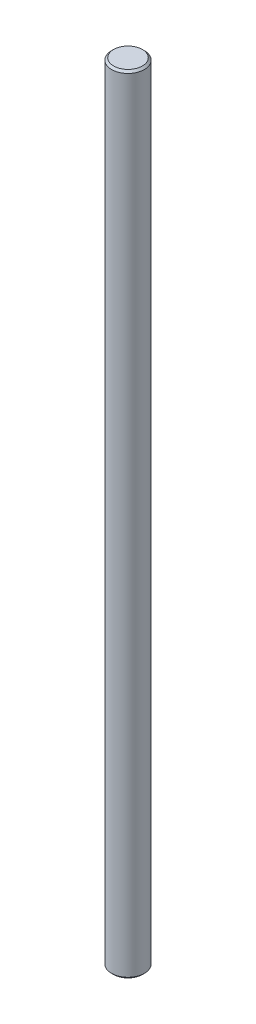
ISO-10303-21;
HEADER;
FILE_DESCRIPTION(('STEP AP214'),'2;1');
FILE_NAME('part.step','',(''),(''),'','','');
FILE_SCHEMA(('AUTOMOTIVE_DESIGN { 1 0 10303 214 1 1 1 1 }'));
ENDSEC;
DATA;
#1=APPLICATION_CONTEXT('core data for automotive mechanical design processes');
#2=APPLICATION_PROTOCOL_DEFINITION('international standard','automotive_design',2000,#1);
#3=PRODUCT_CONTEXT('',#1,'mechanical');
#4=PRODUCT('Part','Part','',(#3));
#5=PRODUCT_RELATED_PRODUCT_CATEGORY('part','',(#4));
#6=PRODUCT_DEFINITION_FORMATION('','',#4);
#7=PRODUCT_DEFINITION_CONTEXT('part definition',#1,'design');
#8=PRODUCT_DEFINITION('design','',#6,#7);
#9=PRODUCT_DEFINITION_SHAPE('','',#8);
#10=(LENGTH_UNIT() NAMED_UNIT(*) SI_UNIT(.MILLI.,.METRE.));
#11=(NAMED_UNIT(*) PLANE_ANGLE_UNIT() SI_UNIT($,.RADIAN.));
#12=(NAMED_UNIT(*) SI_UNIT($,.STERADIAN.) SOLID_ANGLE_UNIT());
#13=UNCERTAINTY_MEASURE_WITH_UNIT(LENGTH_MEASURE(1.E-05),#10,'distance_accuracy_value','');
#14=(GEOMETRIC_REPRESENTATION_CONTEXT(3) GLOBAL_UNCERTAINTY_ASSIGNED_CONTEXT((#13)) GLOBAL_UNIT_ASSIGNED_CONTEXT((#10,
#11,#12)) REPRESENTATION_CONTEXT('',''));
#15=CARTESIAN_POINT('',(0.,0.,0.));
#16=DIRECTION('',(0.,0.,1.));
#17=DIRECTION('',(1.,0.,0.));
#18=AXIS2_PLACEMENT_3D('',#15,#16,#17);
#19=CARTESIAN_POINT('',(0.,192.,0.));
#20=DIRECTION('',(0.,-1.,0.));
#21=DIRECTION('',(0.,0.,-1.));
#22=AXIS2_PLACEMENT_3D('',#19,#20,#21);
#23=CYLINDRICAL_SURFACE('',#22,4.);
#24=CARTESIAN_POINT('',(0.,191.5,0.));
#25=DIRECTION('',(0.,1.,0.));
#26=DIRECTION('',(0.,0.,1.));
#27=AXIS2_PLACEMENT_3D('',#24,#25,#26);
#28=CIRCLE('',#27,4.);
#29=CARTESIAN_POINT('',(0.,191.5,4.));
#30=VERTEX_POINT('',#29);
#31=EDGE_CURVE('E41',#30,#30,#28,.F.);
#32=ORIENTED_EDGE('',*,*,#31,.T.);
#33=EDGE_LOOP('',(#32));
#34=FACE_BOUND('',#33,.T.);
#35=CARTESIAN_POINT('',(0.,0.5,0.));
#36=DIRECTION('',(0.,1.,0.));
#37=DIRECTION('',(0.,0.,1.));
#38=AXIS2_PLACEMENT_3D('',#35,#36,#37);
#39=CIRCLE('',#38,4.);
#40=CARTESIAN_POINT('',(0.,0.5,4.));
#41=VERTEX_POINT('',#40);
#42=EDGE_CURVE('E45',#41,#41,#39,.T.);
#43=ORIENTED_EDGE('',*,*,#42,.T.);
#44=EDGE_LOOP('',(#43));
#45=FACE_BOUND('',#44,.T.);
#46=ADVANCED_FACE('F33',(#34,#45),#23,.T.);
#47=CARTESIAN_POINT('',(0.,192.,0.));
#48=DIRECTION('',(0.,1.,0.));
#49=DIRECTION('',(0.,0.,1.));
#50=AXIS2_PLACEMENT_3D('',#47,#48,#49);
#51=PLANE('',#50);
#52=CARTESIAN_POINT('',(0.,192.,0.));
#53=DIRECTION('',(0.,1.,0.));
#54=DIRECTION('',(0.,0.,1.));
#55=AXIS2_PLACEMENT_3D('',#52,#53,#54);
#56=CIRCLE('',#55,3.5);
#57=CARTESIAN_POINT('',(0.,192.,3.5));
#58=VERTEX_POINT('',#57);
#59=EDGE_CURVE('E49',#58,#58,#56,.T.);
#60=ORIENTED_EDGE('',*,*,#59,.T.);
#61=EDGE_LOOP('',(#60));
#62=FACE_BOUND('',#61,.T.);
#63=ADVANCED_FACE('F55',(#62),#51,.T.);
#64=CARTESIAN_POINT('',(0.,0.,0.));
#65=DIRECTION('',(0.,1.,0.));
#66=DIRECTION('',(0.,0.,1.));
#67=AXIS2_PLACEMENT_3D('',#64,#65,#66);
#68=PLANE('',#67);
#69=CARTESIAN_POINT('',(0.,0.,0.));
#70=DIRECTION('',(0.,1.,0.));
#71=DIRECTION('',(0.,0.,1.));
#72=AXIS2_PLACEMENT_3D('',#69,#70,#71);
#73=CIRCLE('',#72,3.5);
#74=CARTESIAN_POINT('',(0.,0.,3.5));
#75=VERTEX_POINT('',#74);
#76=EDGE_CURVE('E10',#75,#75,#73,.F.);
#77=ORIENTED_EDGE('',*,*,#76,.T.);
#78=EDGE_LOOP('',(#77));
#79=FACE_BOUND('',#78,.T.);
#80=ADVANCED_FACE('F59',(#79),#68,.F.);
#81=CARTESIAN_POINT('',(0.,192.,0.));
#82=DIRECTION('',(0.,-1.,0.));
#83=DIRECTION('',(0.,0.,-1.));
#84=AXIS2_PLACEMENT_3D('',#81,#82,#83);
#85=CONICAL_SURFACE('',#84,3.5,0.785398163397473);
#86=ORIENTED_EDGE('',*,*,#31,.F.);
#87=EDGE_LOOP('',(#86));
#88=FACE_BOUND('',#87,.T.);
#89=ORIENTED_EDGE('',*,*,#59,.F.);
#90=EDGE_LOOP('',(#89));
#91=FACE_BOUND('',#90,.T.);
#92=ADVANCED_FACE('F57',(#88,#91),#85,.T.);
#93=CARTESIAN_POINT('',(0.,0.5,0.));
#94=DIRECTION('',(0.,1.,0.));
#95=DIRECTION('',(0.,0.,1.));
#96=AXIS2_PLACEMENT_3D('',#93,#94,#95);
#97=CONICAL_SURFACE('',#96,4.,0.785398163397445);
#98=ORIENTED_EDGE('',*,*,#76,.F.);
#99=EDGE_LOOP('',(#98));
#100=FACE_BOUND('',#99,.T.);
#101=ORIENTED_EDGE('',*,*,#42,.F.);
#102=EDGE_LOOP('',(#101));
#103=FACE_BOUND('',#102,.T.);
#104=ADVANCED_FACE('F36',(#100,#103),#97,.T.);
#105=CLOSED_SHELL('',(#46,#63,#80,#92,#104));
#106=MANIFOLD_SOLID_BREP('B2',#105);
#107=ADVANCED_BREP_SHAPE_REPRESENTATION('',(#18,#106),#14);
#108=SHAPE_DEFINITION_REPRESENTATION(#9,#107);
ENDSEC;
END-ISO-10303-21;
